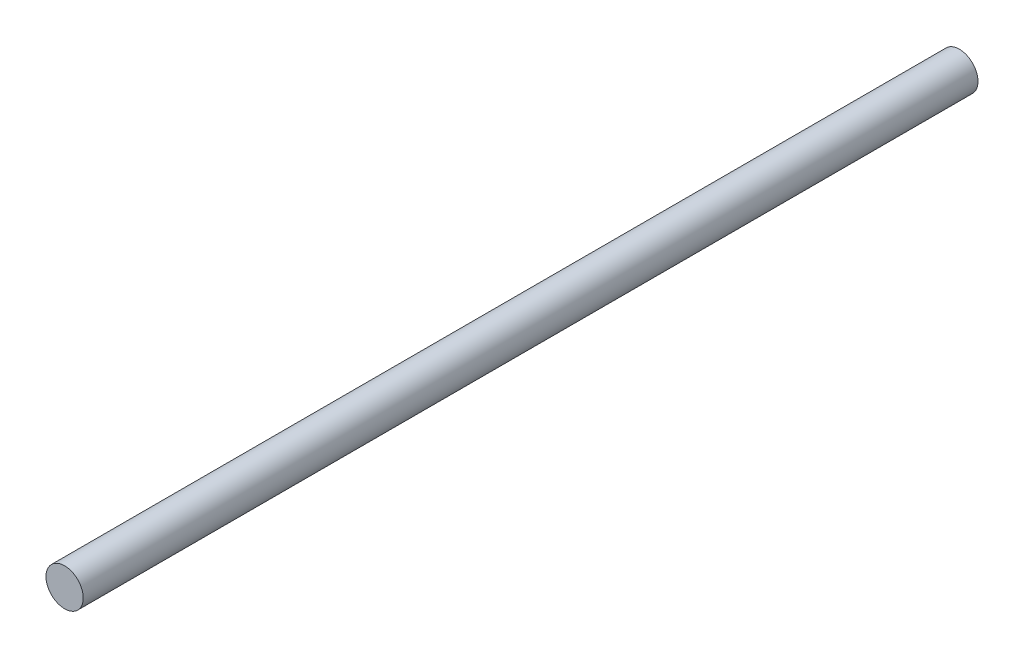
ISO-10303-21;
HEADER;
FILE_DESCRIPTION(('STEP AP214'),'2;1');
FILE_NAME('part.step','',(''),(''),'','','');
FILE_SCHEMA(('AUTOMOTIVE_DESIGN { 1 0 10303 214 1 1 1 1 }'));
ENDSEC;
DATA;
#1=APPLICATION_CONTEXT('core data for automotive mechanical design processes');
#2=APPLICATION_PROTOCOL_DEFINITION('international standard','automotive_design',2000,#1);
#3=PRODUCT_CONTEXT('',#1,'mechanical');
#4=PRODUCT('Part','Part','',(#3));
#5=PRODUCT_RELATED_PRODUCT_CATEGORY('part','',(#4));
#6=PRODUCT_DEFINITION_FORMATION('','',#4);
#7=PRODUCT_DEFINITION_CONTEXT('part definition',#1,'design');
#8=PRODUCT_DEFINITION('design','',#6,#7);
#9=PRODUCT_DEFINITION_SHAPE('','',#8);
#10=(LENGTH_UNIT() NAMED_UNIT(*) SI_UNIT(.MILLI.,.METRE.));
#11=(NAMED_UNIT(*) PLANE_ANGLE_UNIT() SI_UNIT($,.RADIAN.));
#12=(NAMED_UNIT(*) SI_UNIT($,.STERADIAN.) SOLID_ANGLE_UNIT());
#13=UNCERTAINTY_MEASURE_WITH_UNIT(LENGTH_MEASURE(1.E-05),#10,'distance_accuracy_value','');
#14=(GEOMETRIC_REPRESENTATION_CONTEXT(3) GLOBAL_UNCERTAINTY_ASSIGNED_CONTEXT((#13)) GLOBAL_UNIT_ASSIGNED_CONTEXT((#10,
#11,#12)) REPRESENTATION_CONTEXT('',''));
#15=CARTESIAN_POINT('',(0.,0.,0.));
#16=DIRECTION('',(0.,0.,1.));
#17=DIRECTION('',(1.,0.,0.));
#18=AXIS2_PLACEMENT_3D('',#15,#16,#17);
#19=CARTESIAN_POINT('',(0.,0.,-30.));
#20=DIRECTION('',(0.,0.,1.));
#21=DIRECTION('',(1.,0.,0.));
#22=AXIS2_PLACEMENT_3D('',#19,#20,#21);
#23=PLANE('',#22);
#24=CARTESIAN_POINT('',(0.,0.,-30.));
#25=DIRECTION('',(0.,0.,1.));
#26=DIRECTION('',(1.,0.,0.));
#27=AXIS2_PLACEMENT_3D('',#24,#25,#26);
#28=CIRCLE('',#27,1.25);
#29=CARTESIAN_POINT('',(1.24999999999999,0.,-30.));
#30=VERTEX_POINT('',#29);
#31=EDGE_CURVE('E53',#30,#30,#28,.T.);
#32=ORIENTED_EDGE('',*,*,#31,.F.);
#33=EDGE_LOOP('',(#32));
#34=FACE_BOUND('',#33,.T.);
#35=ADVANCED_FACE('F47',(#34),#23,.F.);
#36=CARTESIAN_POINT('',(0.,0.,30.));
#37=DIRECTION('',(0.,0.,1.));
#38=DIRECTION('',(1.,0.,0.));
#39=AXIS2_PLACEMENT_3D('',#36,#37,#38);
#40=PLANE('',#39);
#41=CARTESIAN_POINT('',(0.,0.,30.));
#42=DIRECTION('',(0.,0.,1.));
#43=DIRECTION('',(1.,0.,0.));
#44=AXIS2_PLACEMENT_3D('',#41,#42,#43);
#45=CIRCLE('',#44,1.25);
#46=CARTESIAN_POINT('',(1.25,0.,30.));
#47=VERTEX_POINT('',#46);
#48=EDGE_CURVE('E11',#47,#47,#45,.T.);
#49=ORIENTED_EDGE('',*,*,#48,.T.);
#50=EDGE_LOOP('',(#49));
#51=FACE_BOUND('',#50,.T.);
#52=ADVANCED_FACE('F62',(#51),#40,.T.);
#53=CARTESIAN_POINT('',(0.,0.,-30.));
#54=DIRECTION('',(0.,0.,1.));
#55=DIRECTION('',(1.,0.,0.));
#56=AXIS2_PLACEMENT_3D('',#53,#54,#55);
#57=CYLINDRICAL_SURFACE('',#56,1.25);
#58=ORIENTED_EDGE('',*,*,#48,.F.);
#59=EDGE_LOOP('',(#58));
#60=FACE_BOUND('',#59,.T.);
#61=ORIENTED_EDGE('',*,*,#31,.T.);
#62=EDGE_LOOP('',(#61));
#63=FACE_BOUND('',#62,.T.);
#64=ADVANCED_FACE('F59',(#60,#63),#57,.T.);
#65=CLOSED_SHELL('',(#35,#52,#64));
#66=MANIFOLD_SOLID_BREP('B2',#65);
#67=ADVANCED_BREP_SHAPE_REPRESENTATION('',(#18,#66),#14);
#68=SHAPE_DEFINITION_REPRESENTATION(#9,#67);
ENDSEC;
END-ISO-10303-21;
